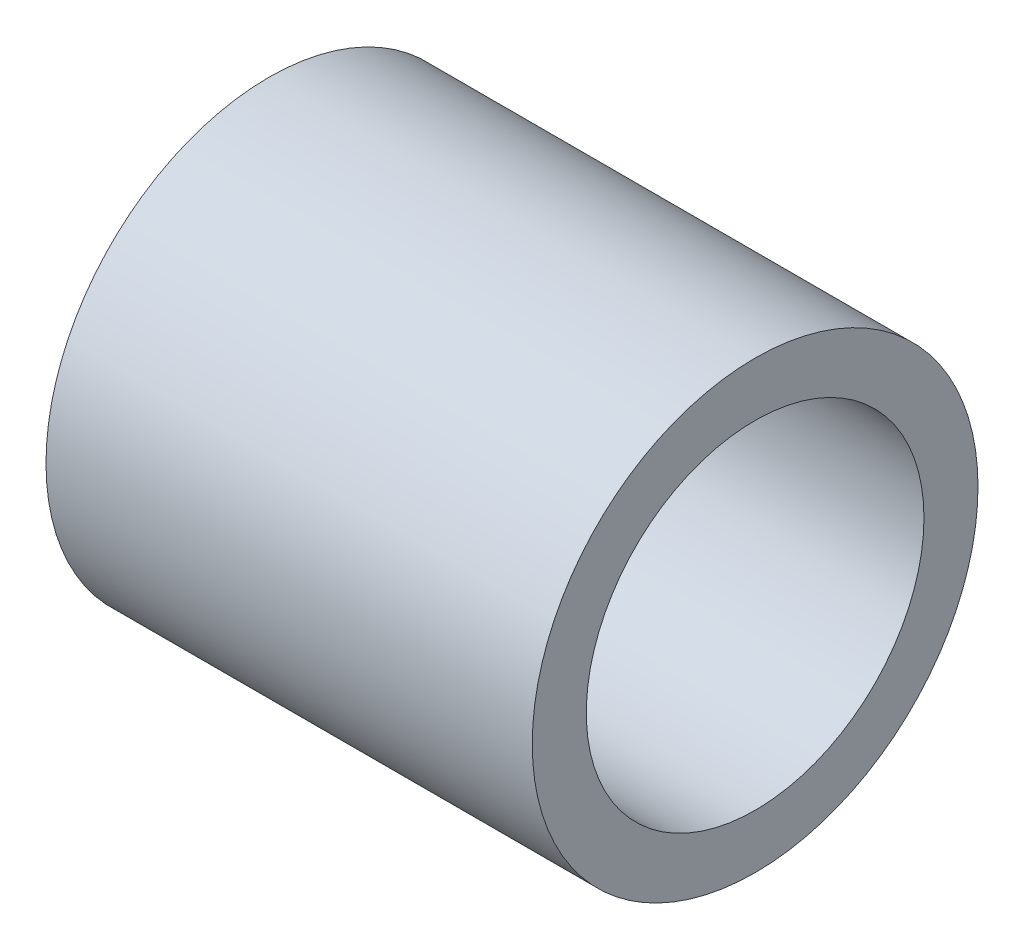
ISO-10303-21;
HEADER;
FILE_DESCRIPTION(('STEP AP214'),'2;1');
FILE_NAME('part.step','',(''),(''),'','','');
FILE_SCHEMA(('AUTOMOTIVE_DESIGN { 1 0 10303 214 1 1 1 1 }'));
ENDSEC;
DATA;
#1=APPLICATION_CONTEXT('core data for automotive mechanical design processes');
#2=APPLICATION_PROTOCOL_DEFINITION('international standard','automotive_design',2000,#1);
#3=PRODUCT_CONTEXT('',#1,'mechanical');
#4=PRODUCT('Part','Part','',(#3));
#5=PRODUCT_RELATED_PRODUCT_CATEGORY('part','',(#4));
#6=PRODUCT_DEFINITION_FORMATION('','',#4);
#7=PRODUCT_DEFINITION_CONTEXT('part definition',#1,'design');
#8=PRODUCT_DEFINITION('design','',#6,#7);
#9=PRODUCT_DEFINITION_SHAPE('','',#8);
#10=(LENGTH_UNIT() NAMED_UNIT(*) SI_UNIT(.MILLI.,.METRE.));
#11=(NAMED_UNIT(*) PLANE_ANGLE_UNIT() SI_UNIT($,.RADIAN.));
#12=(NAMED_UNIT(*) SI_UNIT($,.STERADIAN.) SOLID_ANGLE_UNIT());
#13=UNCERTAINTY_MEASURE_WITH_UNIT(LENGTH_MEASURE(1.E-05),#10,'distance_accuracy_value','');
#14=(GEOMETRIC_REPRESENTATION_CONTEXT(3) GLOBAL_UNCERTAINTY_ASSIGNED_CONTEXT((#13)) GLOBAL_UNIT_ASSIGNED_CONTEXT((#10,
#11,#12)) REPRESENTATION_CONTEXT('',''));
#15=CARTESIAN_POINT('',(0.,0.,0.));
#16=DIRECTION('',(0.,0.,1.));
#17=DIRECTION('',(1.,0.,0.));
#18=AXIS2_PLACEMENT_3D('',#15,#16,#17);
#19=CARTESIAN_POINT('',(22.86,0.,0.));
#20=DIRECTION('',(-1.,0.,0.));
#21=DIRECTION('',(0.,0.,1.));
#22=AXIS2_PLACEMENT_3D('',#19,#20,#21);
#23=CYLINDRICAL_SURFACE('',#22,10.4775);
#24=CARTESIAN_POINT('',(22.86,0.,0.));
#25=DIRECTION('',(1.,0.,0.));
#26=DIRECTION('',(0.,0.,-1.));
#27=AXIS2_PLACEMENT_3D('',#24,#25,#26);
#28=CIRCLE('',#27,10.4775);
#29=CARTESIAN_POINT('',(22.86,0.,-10.4775));
#30=VERTEX_POINT('',#29);
#31=EDGE_CURVE('E10',#30,#30,#28,.T.);
#32=ORIENTED_EDGE('',*,*,#31,.F.);
#33=EDGE_LOOP('',(#32));
#34=FACE_BOUND('',#33,.T.);
#35=CARTESIAN_POINT('',(0.,0.,0.));
#36=DIRECTION('',(1.,0.,0.));
#37=DIRECTION('',(0.,0.,-1.));
#38=AXIS2_PLACEMENT_3D('',#35,#36,#37);
#39=CIRCLE('',#38,10.4775);
#40=CARTESIAN_POINT('',(0.,0.,-10.4775));
#41=VERTEX_POINT('',#40);
#42=EDGE_CURVE('E50',#41,#41,#39,.T.);
#43=ORIENTED_EDGE('',*,*,#42,.T.);
#44=EDGE_LOOP('',(#43));
#45=FACE_BOUND('',#44,.T.);
#46=ADVANCED_FACE('F47',(#34,#45),#23,.T.);
#47=CARTESIAN_POINT('',(22.86,0.,0.));
#48=DIRECTION('',(1.,0.,0.));
#49=DIRECTION('',(0.,0.,-1.));
#50=AXIS2_PLACEMENT_3D('',#47,#48,#49);
#51=PLANE('',#50);
#52=CARTESIAN_POINT('',(22.86,0.,0.));
#53=DIRECTION('',(1.,0.,0.));
#54=DIRECTION('',(0.,0.,-1.));
#55=AXIS2_PLACEMENT_3D('',#52,#53,#54);
#56=CIRCLE('',#55,7.9375);
#57=CARTESIAN_POINT('',(22.86,0.,-7.9375));
#58=VERTEX_POINT('',#57);
#59=EDGE_CURVE('E64',#58,#58,#56,.T.);
#60=ORIENTED_EDGE('',*,*,#59,.F.);
#61=EDGE_LOOP('',(#60));
#62=FACE_BOUND('',#61,.T.);
#63=ORIENTED_EDGE('',*,*,#31,.T.);
#64=EDGE_LOOP('',(#63));
#65=FACE_BOUND('',#64,.T.);
#66=ADVANCED_FACE('F71',(#62,#65),#51,.T.);
#67=CARTESIAN_POINT('',(0.,0.,0.));
#68=DIRECTION('',(1.,0.,0.));
#69=DIRECTION('',(0.,0.,-1.));
#70=AXIS2_PLACEMENT_3D('',#67,#68,#69);
#71=PLANE('',#70);
#72=CARTESIAN_POINT('',(0.,0.,0.));
#73=DIRECTION('',(1.,0.,0.));
#74=DIRECTION('',(0.,0.,-1.));
#75=AXIS2_PLACEMENT_3D('',#72,#73,#74);
#76=CIRCLE('',#75,7.9375);
#77=CARTESIAN_POINT('',(0.,0.,-7.9375));
#78=VERTEX_POINT('',#77);
#79=EDGE_CURVE('E59',#78,#78,#76,.T.);
#80=ORIENTED_EDGE('',*,*,#79,.T.);
#81=EDGE_LOOP('',(#80));
#82=FACE_BOUND('',#81,.T.);
#83=ORIENTED_EDGE('',*,*,#42,.F.);
#84=EDGE_LOOP('',(#83));
#85=FACE_BOUND('',#84,.T.);
#86=ADVANCED_FACE('F73',(#82,#85),#71,.F.);
#87=CARTESIAN_POINT('',(22.86,0.,0.));
#88=DIRECTION('',(1.,0.,0.));
#89=DIRECTION('',(0.,0.,-1.));
#90=AXIS2_PLACEMENT_3D('',#87,#88,#89);
#91=CYLINDRICAL_SURFACE('',#90,7.9375);
#92=ORIENTED_EDGE('',*,*,#79,.F.);
#93=EDGE_LOOP('',(#92));
#94=FACE_BOUND('',#93,.T.);
#95=ORIENTED_EDGE('',*,*,#59,.T.);
#96=EDGE_LOOP('',(#95));
#97=FACE_BOUND('',#96,.T.);
#98=ADVANCED_FACE('F69',(#94,#97),#91,.F.);
#99=CLOSED_SHELL('',(#46,#66,#86,#98));
#100=MANIFOLD_SOLID_BREP('B2',#99);
#101=ADVANCED_BREP_SHAPE_REPRESENTATION('',(#18,#100),#14);
#102=SHAPE_DEFINITION_REPRESENTATION(#9,#101);
ENDSEC;
END-ISO-10303-21;
